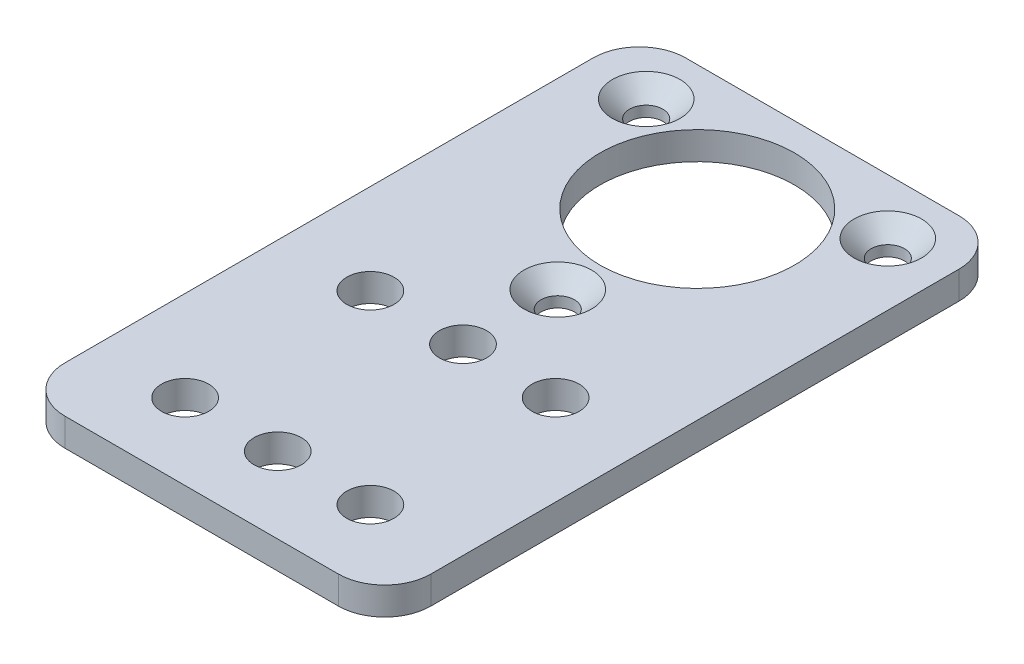
ISO-10303-21;
HEADER;
FILE_DESCRIPTION(('STEP AP214'),'2;1');
FILE_NAME('part.step','',(''),(''),'','','');
FILE_SCHEMA(('AUTOMOTIVE_DESIGN { 1 0 10303 214 1 1 1 1 }'));
ENDSEC;
DATA;
#1=APPLICATION_CONTEXT('core data for automotive mechanical design processes');
#2=APPLICATION_PROTOCOL_DEFINITION('international standard','automotive_design',2000,#1);
#3=PRODUCT_CONTEXT('',#1,'mechanical');
#4=PRODUCT('Part','Part','',(#3));
#5=PRODUCT_RELATED_PRODUCT_CATEGORY('part','',(#4));
#6=PRODUCT_DEFINITION_FORMATION('','',#4);
#7=PRODUCT_DEFINITION_CONTEXT('part definition',#1,'design');
#8=PRODUCT_DEFINITION('design','',#6,#7);
#9=PRODUCT_DEFINITION_SHAPE('','',#8);
#10=(LENGTH_UNIT() NAMED_UNIT(*) SI_UNIT(.MILLI.,.METRE.));
#11=(NAMED_UNIT(*) PLANE_ANGLE_UNIT() SI_UNIT($,.RADIAN.));
#12=(NAMED_UNIT(*) SI_UNIT($,.STERADIAN.) SOLID_ANGLE_UNIT());
#13=UNCERTAINTY_MEASURE_WITH_UNIT(LENGTH_MEASURE(1.E-05),#10,'distance_accuracy_value','');
#14=(GEOMETRIC_REPRESENTATION_CONTEXT(3) GLOBAL_UNCERTAINTY_ASSIGNED_CONTEXT((#13)) GLOBAL_UNIT_ASSIGNED_CONTEXT((#10,
#11,#12)) REPRESENTATION_CONTEXT('',''));
#15=CARTESIAN_POINT('',(0.,0.,0.));
#16=DIRECTION('',(0.,0.,1.));
#17=DIRECTION('',(1.,0.,0.));
#18=AXIS2_PLACEMENT_3D('',#15,#16,#17);
#19=CARTESIAN_POINT('',(-14.75,3.,28.5));
#20=DIRECTION('',(0.,-1.,0.));
#21=DIRECTION('',(0.,0.,-1.));
#22=AXIS2_PLACEMENT_3D('',#19,#20,#21);
#23=PLANE('',#22);
#24=CARTESIAN_POINT('',(-13.0423425809937,3.,-27.5299999999999));
#25=DIRECTION('',(0.,1.,0.));
#26=DIRECTION('',(0.,0.,1.));
#27=AXIS2_PLACEMENT_3D('',#24,#25,#26);
#28=CIRCLE('',#27,3.65);
#29=CARTESIAN_POINT('',(-13.0423425809937,3.,-23.8799999999999));
#30=VERTEX_POINT('',#29);
#31=EDGE_CURVE('E260',#30,#30,#28,.T.);
#32=ORIENTED_EDGE('',*,*,#31,.F.);
#33=EDGE_LOOP('',(#32));
#34=FACE_BOUND('',#33,.T.);
#35=CARTESIAN_POINT('',(13.0423425809936,3.,-27.5300000000001));
#36=DIRECTION('',(0.,1.,0.));
#37=DIRECTION('',(0.,0.,1.));
#38=AXIS2_PLACEMENT_3D('',#35,#36,#37);
#39=CIRCLE('',#38,3.65);
#40=CARTESIAN_POINT('',(13.0423425809936,3.,-23.8800000000001));
#41=VERTEX_POINT('',#40);
#42=EDGE_CURVE('E251',#41,#41,#39,.T.);
#43=ORIENTED_EDGE('',*,*,#42,.F.);
#44=EDGE_LOOP('',(#43));
#45=FACE_BOUND('',#44,.T.);
#46=CARTESIAN_POINT('',(0.,3.,-20.));
#47=DIRECTION('',(0.,1.,0.));
#48=DIRECTION('',(0.,0.,1.));
#49=AXIS2_PLACEMENT_3D('',#46,#47,#48);
#50=CIRCLE('',#49,10.5);
#51=CARTESIAN_POINT('',(0.,3.,-9.5));
#52=VERTEX_POINT('',#51);
#53=EDGE_CURVE('E231',#52,#52,#50,.T.);
#54=ORIENTED_EDGE('',*,*,#53,.F.);
#55=EDGE_LOOP('',(#54));
#56=FACE_BOUND('',#55,.T.);
#57=CARTESIAN_POINT('',(-14.75,3.,28.5));
#58=DIRECTION('',(0.,1.,0.));
#59=DIRECTION('',(0.,0.,-1.));
#60=AXIS2_PLACEMENT_3D('',#57,#58,#59);
#61=CIRCLE('',#60,5.);
#62=CARTESIAN_POINT('',(-19.75,3.,28.5));
#63=VERTEX_POINT('',#62);
#64=CARTESIAN_POINT('',(-14.75,3.,33.5));
#65=VERTEX_POINT('',#64);
#66=EDGE_CURVE('E161',#63,#65,#61,.T.);
#67=ORIENTED_EDGE('',*,*,#66,.T.);
#68=DIRECTION('',(1.,0.,0.));
#69=VECTOR('',#68,1.);
#70=CARTESIAN_POINT('',(14.75,3.,33.5));
#71=LINE('',#70,#69);
#72=CARTESIAN_POINT('',(14.75,3.,33.5));
#73=VERTEX_POINT('',#72);
#74=EDGE_CURVE('E109',#65,#73,#71,.T.);
#75=ORIENTED_EDGE('',*,*,#74,.T.);
#76=CARTESIAN_POINT('',(14.75,3.,28.5));
#77=DIRECTION('',(0.,1.,0.));
#78=DIRECTION('',(0.,0.,1.));
#79=AXIS2_PLACEMENT_3D('',#76,#77,#78);
#80=CIRCLE('',#79,5.00000000000001);
#81=CARTESIAN_POINT('',(19.75,3.,28.5));
#82=VERTEX_POINT('',#81);
#83=EDGE_CURVE('E176',#73,#82,#80,.T.);
#84=ORIENTED_EDGE('',*,*,#83,.T.);
#85=DIRECTION('',(0.,0.,-1.));
#86=VECTOR('',#85,1.);
#87=CARTESIAN_POINT('',(19.75,3.,28.5));
#88=LINE('',#87,#86);
#89=CARTESIAN_POINT('',(19.75,3.,-28.5));
#90=VERTEX_POINT('',#89);
#91=EDGE_CURVE('E189',#82,#90,#88,.T.);
#92=ORIENTED_EDGE('',*,*,#91,.T.);
#93=CARTESIAN_POINT('',(14.75,3.,-28.5));
#94=DIRECTION('',(0.,1.,0.));
#95=DIRECTION('',(0.,0.,1.));
#96=AXIS2_PLACEMENT_3D('',#93,#94,#95);
#97=CIRCLE('',#96,5.);
#98=CARTESIAN_POINT('',(14.75,3.,-33.5));
#99=VERTEX_POINT('',#98);
#100=EDGE_CURVE('E128',#90,#99,#97,.T.);
#101=ORIENTED_EDGE('',*,*,#100,.T.);
#102=DIRECTION('',(-1.,0.,0.));
#103=VECTOR('',#102,1.);
#104=CARTESIAN_POINT('',(14.75,3.,-33.5));
#105=LINE('',#104,#103);
#106=CARTESIAN_POINT('',(-14.75,3.,-33.5));
#107=VERTEX_POINT('',#106);
#108=EDGE_CURVE('E122',#99,#107,#105,.T.);
#109=ORIENTED_EDGE('',*,*,#108,.T.);
#110=CARTESIAN_POINT('',(-14.75,3.,-28.5));
#111=DIRECTION('',(0.,1.,0.));
#112=DIRECTION('',(0.,0.,1.));
#113=AXIS2_PLACEMENT_3D('',#110,#111,#112);
#114=CIRCLE('',#113,5.);
#115=CARTESIAN_POINT('',(-19.75,3.,-28.5));
#116=VERTEX_POINT('',#115);
#117=EDGE_CURVE('E126',#107,#116,#114,.T.);
#118=ORIENTED_EDGE('',*,*,#117,.T.);
#119=DIRECTION('',(0.,0.,1.));
#120=VECTOR('',#119,1.);
#121=CARTESIAN_POINT('',(-19.75,3.,28.5));
#122=LINE('',#121,#120);
#123=EDGE_CURVE('E66',#116,#63,#122,.T.);
#124=ORIENTED_EDGE('',*,*,#123,.T.);
#125=EDGE_LOOP('',(#67,#75,#84,#92,#101,#109,#118,#124));
#126=FACE_BOUND('',#125,.T.);
#127=CARTESIAN_POINT('',(10.,3.,25.29));
#128=DIRECTION('',(0.,1.,0.));
#129=DIRECTION('',(0.,0.,1.));
#130=AXIS2_PLACEMENT_3D('',#127,#128,#129);
#131=CIRCLE('',#130,2.55);
#132=CARTESIAN_POINT('',(10.,3.,27.84));
#133=VERTEX_POINT('',#132);
#134=EDGE_CURVE('E150',#133,#133,#131,.T.);
#135=ORIENTED_EDGE('',*,*,#134,.F.);
#136=EDGE_LOOP('',(#135));
#137=FACE_BOUND('',#136,.T.);
#138=CARTESIAN_POINT('',(10.,3.,5.29));
#139=DIRECTION('',(0.,1.,0.));
#140=DIRECTION('',(0.,0.,1.));
#141=AXIS2_PLACEMENT_3D('',#138,#139,#140);
#142=CIRCLE('',#141,2.55);
#143=CARTESIAN_POINT('',(10.,3.,7.84));
#144=VERTEX_POINT('',#143);
#145=EDGE_CURVE('E198',#144,#144,#142,.T.);
#146=ORIENTED_EDGE('',*,*,#145,.F.);
#147=EDGE_LOOP('',(#146));
#148=FACE_BOUND('',#147,.T.);
#149=CARTESIAN_POINT('',(0.,3.,25.29));
#150=DIRECTION('',(0.,1.,0.));
#151=DIRECTION('',(0.,0.,1.));
#152=AXIS2_PLACEMENT_3D('',#149,#150,#151);
#153=CIRCLE('',#152,2.55);
#154=CARTESIAN_POINT('',(0.,3.,27.84));
#155=VERTEX_POINT('',#154);
#156=EDGE_CURVE('E204',#155,#155,#153,.T.);
#157=ORIENTED_EDGE('',*,*,#156,.F.);
#158=EDGE_LOOP('',(#157));
#159=FACE_BOUND('',#158,.T.);
#160=CARTESIAN_POINT('',(0.,3.,5.29));
#161=DIRECTION('',(0.,1.,0.));
#162=DIRECTION('',(0.,0.,1.));
#163=AXIS2_PLACEMENT_3D('',#160,#161,#162);
#164=CIRCLE('',#163,2.55);
#165=CARTESIAN_POINT('',(0.,3.,7.84));
#166=VERTEX_POINT('',#165);
#167=EDGE_CURVE('E210',#166,#166,#164,.T.);
#168=ORIENTED_EDGE('',*,*,#167,.F.);
#169=EDGE_LOOP('',(#168));
#170=FACE_BOUND('',#169,.T.);
#171=CARTESIAN_POINT('',(-9.99999999999999,3.,25.29));
#172=DIRECTION('',(0.,1.,0.));
#173=DIRECTION('',(0.,0.,1.));
#174=AXIS2_PLACEMENT_3D('',#171,#172,#173);
#175=CIRCLE('',#174,2.55);
#176=CARTESIAN_POINT('',(-9.99999999999999,3.,27.84));
#177=VERTEX_POINT('',#176);
#178=EDGE_CURVE('E216',#177,#177,#175,.T.);
#179=ORIENTED_EDGE('',*,*,#178,.F.);
#180=EDGE_LOOP('',(#179));
#181=FACE_BOUND('',#180,.T.);
#182=CARTESIAN_POINT('',(-9.99999999999999,3.,5.29));
#183=DIRECTION('',(0.,1.,0.));
#184=DIRECTION('',(0.,0.,1.));
#185=AXIS2_PLACEMENT_3D('',#182,#183,#184);
#186=CIRCLE('',#185,2.55);
#187=CARTESIAN_POINT('',(-9.99999999999999,3.,7.84));
#188=VERTEX_POINT('',#187);
#189=EDGE_CURVE('E222',#188,#188,#186,.T.);
#190=ORIENTED_EDGE('',*,*,#189,.F.);
#191=EDGE_LOOP('',(#190));
#192=FACE_BOUND('',#191,.T.);
#193=CARTESIAN_POINT('',(0.,3.,-4.94));
#194=DIRECTION('',(0.,1.,0.));
#195=DIRECTION('',(0.,0.,1.));
#196=AXIS2_PLACEMENT_3D('',#193,#194,#195);
#197=CIRCLE('',#196,3.65);
#198=CARTESIAN_POINT('',(0.,3.,-1.29));
#199=VERTEX_POINT('',#198);
#200=EDGE_CURVE('E242',#199,#199,#197,.T.);
#201=ORIENTED_EDGE('',*,*,#200,.F.);
#202=EDGE_LOOP('',(#201));
#203=FACE_BOUND('',#202,.T.);
#204=ADVANCED_FACE('F49',(#34,#45,#56,#126,#137,#148,#159,#170,#181,#192,#203),#23,.F.);
#205=CARTESIAN_POINT('',(-14.75,0.,28.5));
#206=DIRECTION('',(0.,-1.,0.));
#207=DIRECTION('',(0.,0.,-1.));
#208=AXIS2_PLACEMENT_3D('',#205,#206,#207);
#209=PLANE('',#208);
#210=CARTESIAN_POINT('',(-13.0423425809937,0.,-27.5299999999999));
#211=DIRECTION('',(0.,1.,0.));
#212=DIRECTION('',(0.,0.,1.));
#213=AXIS2_PLACEMENT_3D('',#210,#211,#212);
#214=CIRCLE('',#213,1.8);
#215=CARTESIAN_POINT('',(-13.0423425809937,0.,-25.7299999999999));
#216=VERTEX_POINT('',#215);
#217=EDGE_CURVE('E254',#216,#216,#214,.T.);
#218=ORIENTED_EDGE('',*,*,#217,.T.);
#219=EDGE_LOOP('',(#218));
#220=FACE_BOUND('',#219,.T.);
#221=CARTESIAN_POINT('',(13.0423425809936,0.,-27.5300000000001));
#222=DIRECTION('',(0.,1.,0.));
#223=DIRECTION('',(0.,0.,1.));
#224=AXIS2_PLACEMENT_3D('',#221,#222,#223);
#225=CIRCLE('',#224,1.8);
#226=CARTESIAN_POINT('',(13.0423425809936,0.,-25.7300000000001));
#227=VERTEX_POINT('',#226);
#228=EDGE_CURVE('E245',#227,#227,#225,.T.);
#229=ORIENTED_EDGE('',*,*,#228,.T.);
#230=EDGE_LOOP('',(#229));
#231=FACE_BOUND('',#230,.T.);
#232=CARTESIAN_POINT('',(0.,0.,-4.94));
#233=DIRECTION('',(0.,1.,0.));
#234=DIRECTION('',(0.,0.,1.));
#235=AXIS2_PLACEMENT_3D('',#232,#233,#234);
#236=CIRCLE('',#235,1.8);
#237=CARTESIAN_POINT('',(0.,0.,-3.14));
#238=VERTEX_POINT('',#237);
#239=EDGE_CURVE('E234',#238,#238,#236,.T.);
#240=ORIENTED_EDGE('',*,*,#239,.T.);
#241=EDGE_LOOP('',(#240));
#242=FACE_BOUND('',#241,.T.);
#243=CARTESIAN_POINT('',(0.,0.,-20.));
#244=DIRECTION('',(0.,1.,0.));
#245=DIRECTION('',(0.,0.,1.));
#246=AXIS2_PLACEMENT_3D('',#243,#244,#245);
#247=CIRCLE('',#246,10.5);
#248=CARTESIAN_POINT('',(0.,0.,-9.5));
#249=VERTEX_POINT('',#248);
#250=EDGE_CURVE('E228',#249,#249,#247,.T.);
#251=ORIENTED_EDGE('',*,*,#250,.T.);
#252=EDGE_LOOP('',(#251));
#253=FACE_BOUND('',#252,.T.);
#254=CARTESIAN_POINT('',(-9.99999999999999,0.,25.29));
#255=DIRECTION('',(0.,1.,0.));
#256=DIRECTION('',(0.,0.,1.));
#257=AXIS2_PLACEMENT_3D('',#254,#255,#256);
#258=CIRCLE('',#257,2.55);
#259=CARTESIAN_POINT('',(-9.99999999999999,0.,27.84));
#260=VERTEX_POINT('',#259);
#261=EDGE_CURVE('E219',#260,#260,#258,.T.);
#262=ORIENTED_EDGE('',*,*,#261,.T.);
#263=EDGE_LOOP('',(#262));
#264=FACE_BOUND('',#263,.T.);
#265=CARTESIAN_POINT('',(0.,0.,25.29));
#266=DIRECTION('',(0.,1.,0.));
#267=DIRECTION('',(0.,0.,1.));
#268=AXIS2_PLACEMENT_3D('',#265,#266,#267);
#269=CIRCLE('',#268,2.55);
#270=CARTESIAN_POINT('',(0.,0.,27.84));
#271=VERTEX_POINT('',#270);
#272=EDGE_CURVE('E207',#271,#271,#269,.T.);
#273=ORIENTED_EDGE('',*,*,#272,.T.);
#274=EDGE_LOOP('',(#273));
#275=FACE_BOUND('',#274,.T.);
#276=CARTESIAN_POINT('',(10.,0.,25.29));
#277=DIRECTION('',(0.,1.,0.));
#278=DIRECTION('',(0.,0.,1.));
#279=AXIS2_PLACEMENT_3D('',#276,#277,#278);
#280=CIRCLE('',#279,2.55);
#281=CARTESIAN_POINT('',(10.,0.,27.84));
#282=VERTEX_POINT('',#281);
#283=EDGE_CURVE('E195',#282,#282,#280,.T.);
#284=ORIENTED_EDGE('',*,*,#283,.T.);
#285=EDGE_LOOP('',(#284));
#286=FACE_BOUND('',#285,.T.);
#287=CARTESIAN_POINT('',(-14.75,0.,28.5));
#288=DIRECTION('',(0.,1.,0.));
#289=DIRECTION('',(0.,0.,-1.));
#290=AXIS2_PLACEMENT_3D('',#287,#288,#289);
#291=CIRCLE('',#290,5.);
#292=CARTESIAN_POINT('',(-19.75,0.,28.5));
#293=VERTEX_POINT('',#292);
#294=CARTESIAN_POINT('',(-14.75,0.,33.5));
#295=VERTEX_POINT('',#294);
#296=EDGE_CURVE('E146',#293,#295,#291,.T.);
#297=ORIENTED_EDGE('',*,*,#296,.F.);
#298=DIRECTION('',(0.,0.,1.));
#299=VECTOR('',#298,1.);
#300=CARTESIAN_POINT('',(-19.75,0.,28.5));
#301=LINE('',#300,#299);
#302=CARTESIAN_POINT('',(-19.75,0.,-28.5));
#303=VERTEX_POINT('',#302);
#304=EDGE_CURVE('E101',#303,#293,#301,.T.);
#305=ORIENTED_EDGE('',*,*,#304,.F.);
#306=CARTESIAN_POINT('',(-14.75,0.,-28.5));
#307=DIRECTION('',(0.,1.,0.));
#308=DIRECTION('',(0.,0.,1.));
#309=AXIS2_PLACEMENT_3D('',#306,#307,#308);
#310=CIRCLE('',#309,5.);
#311=CARTESIAN_POINT('',(-14.75,0.,-33.5));
#312=VERTEX_POINT('',#311);
#313=EDGE_CURVE('E95',#312,#303,#310,.T.);
#314=ORIENTED_EDGE('',*,*,#313,.F.);
#315=DIRECTION('',(-1.,0.,0.));
#316=VECTOR('',#315,1.);
#317=CARTESIAN_POINT('',(14.75,0.,-33.5));
#318=LINE('',#317,#316);
#319=CARTESIAN_POINT('',(14.75,0.,-33.5));
#320=VERTEX_POINT('',#319);
#321=EDGE_CURVE('E136',#320,#312,#318,.T.);
#322=ORIENTED_EDGE('',*,*,#321,.F.);
#323=CARTESIAN_POINT('',(14.75,0.,-28.5));
#324=DIRECTION('',(0.,1.,0.));
#325=DIRECTION('',(0.,0.,1.));
#326=AXIS2_PLACEMENT_3D('',#323,#324,#325);
#327=CIRCLE('',#326,5.);
#328=CARTESIAN_POINT('',(19.75,0.,-28.5));
#329=VERTEX_POINT('',#328);
#330=EDGE_CURVE('E156',#329,#320,#327,.T.);
#331=ORIENTED_EDGE('',*,*,#330,.F.);
#332=DIRECTION('',(0.,0.,-1.));
#333=VECTOR('',#332,1.);
#334=CARTESIAN_POINT('',(19.75,0.,28.5));
#335=LINE('',#334,#333);
#336=CARTESIAN_POINT('',(19.75,0.,28.5));
#337=VERTEX_POINT('',#336);
#338=EDGE_CURVE('E154',#337,#329,#335,.T.);
#339=ORIENTED_EDGE('',*,*,#338,.F.);
#340=CARTESIAN_POINT('',(14.75,0.,28.5));
#341=DIRECTION('',(0.,1.,0.));
#342=DIRECTION('',(0.,0.,1.));
#343=AXIS2_PLACEMENT_3D('',#340,#341,#342);
#344=CIRCLE('',#343,5.00000000000001);
#345=CARTESIAN_POINT('',(14.75,0.,33.5));
#346=VERTEX_POINT('',#345);
#347=EDGE_CURVE('E152',#346,#337,#344,.T.);
#348=ORIENTED_EDGE('',*,*,#347,.F.);
#349=DIRECTION('',(1.,0.,0.));
#350=VECTOR('',#349,1.);
#351=CARTESIAN_POINT('',(14.75,0.,33.5));
#352=LINE('',#351,#350);
#353=EDGE_CURVE('E149',#295,#346,#352,.T.);
#354=ORIENTED_EDGE('',*,*,#353,.F.);
#355=EDGE_LOOP('',(#297,#305,#314,#322,#331,#339,#348,#354));
#356=FACE_BOUND('',#355,.T.);
#357=CARTESIAN_POINT('',(10.,0.,5.29));
#358=DIRECTION('',(0.,1.,0.));
#359=DIRECTION('',(0.,0.,1.));
#360=AXIS2_PLACEMENT_3D('',#357,#358,#359);
#361=CIRCLE('',#360,2.55);
#362=CARTESIAN_POINT('',(10.,0.,7.84));
#363=VERTEX_POINT('',#362);
#364=EDGE_CURVE('E201',#363,#363,#361,.T.);
#365=ORIENTED_EDGE('',*,*,#364,.T.);
#366=EDGE_LOOP('',(#365));
#367=FACE_BOUND('',#366,.T.);
#368=CARTESIAN_POINT('',(0.,0.,5.29));
#369=DIRECTION('',(0.,1.,0.));
#370=DIRECTION('',(0.,0.,1.));
#371=AXIS2_PLACEMENT_3D('',#368,#369,#370);
#372=CIRCLE('',#371,2.55);
#373=CARTESIAN_POINT('',(0.,0.,7.84));
#374=VERTEX_POINT('',#373);
#375=EDGE_CURVE('E213',#374,#374,#372,.T.);
#376=ORIENTED_EDGE('',*,*,#375,.T.);
#377=EDGE_LOOP('',(#376));
#378=FACE_BOUND('',#377,.T.);
#379=CARTESIAN_POINT('',(-9.99999999999999,0.,5.29));
#380=DIRECTION('',(0.,1.,0.));
#381=DIRECTION('',(0.,0.,1.));
#382=AXIS2_PLACEMENT_3D('',#379,#380,#381);
#383=CIRCLE('',#382,2.55);
#384=CARTESIAN_POINT('',(-9.99999999999999,0.,7.84));
#385=VERTEX_POINT('',#384);
#386=EDGE_CURVE('E225',#385,#385,#383,.T.);
#387=ORIENTED_EDGE('',*,*,#386,.T.);
#388=EDGE_LOOP('',(#387));
#389=FACE_BOUND('',#388,.T.);
#390=ADVANCED_FACE('F180',(#220,#231,#242,#253,#264,#275,#286,#356,#367,#378,#389),#209,.T.);
#391=CARTESIAN_POINT('',(-14.75,3.,28.5));
#392=DIRECTION('',(0.,-1.,0.));
#393=DIRECTION('',(0.,0.,-1.));
#394=AXIS2_PLACEMENT_3D('',#391,#392,#393);
#395=CYLINDRICAL_SURFACE('',#394,5.);
#396=ORIENTED_EDGE('',*,*,#296,.T.);
#397=DIRECTION('',(0.,-1.,0.));
#398=VECTOR('',#397,1.);
#399=CARTESIAN_POINT('',(-14.75,3.,33.5));
#400=LINE('',#399,#398);
#401=EDGE_CURVE('E13',#65,#295,#400,.T.);
#402=ORIENTED_EDGE('',*,*,#401,.F.);
#403=ORIENTED_EDGE('',*,*,#66,.F.);
#404=DIRECTION('',(0.,-1.,0.));
#405=VECTOR('',#404,1.);
#406=CARTESIAN_POINT('',(-19.75,3.,28.5));
#407=LINE('',#406,#405);
#408=EDGE_CURVE('E142',#63,#293,#407,.T.);
#409=ORIENTED_EDGE('',*,*,#408,.T.);
#410=EDGE_LOOP('',(#396,#402,#403,#409));
#411=FACE_BOUND('',#410,.T.);
#412=ADVANCED_FACE('F51',(#411),#395,.T.);
#413=CARTESIAN_POINT('',(14.75,3.,33.5));
#414=DIRECTION('',(0.,0.,-1.));
#415=DIRECTION('',(-1.,0.,0.));
#416=AXIS2_PLACEMENT_3D('',#413,#414,#415);
#417=PLANE('',#416);
#418=ORIENTED_EDGE('',*,*,#353,.T.);
#419=DIRECTION('',(0.,-1.,0.));
#420=VECTOR('',#419,1.);
#421=CARTESIAN_POINT('',(14.75,3.,33.5));
#422=LINE('',#421,#420);
#423=EDGE_CURVE('E58',#73,#346,#422,.T.);
#424=ORIENTED_EDGE('',*,*,#423,.F.);
#425=ORIENTED_EDGE('',*,*,#74,.F.);
#426=ORIENTED_EDGE('',*,*,#401,.T.);
#427=EDGE_LOOP('',(#418,#424,#425,#426));
#428=FACE_BOUND('',#427,.T.);
#429=ADVANCED_FACE('F326',(#428),#417,.F.);
#430=CARTESIAN_POINT('',(14.75,3.,28.5));
#431=DIRECTION('',(0.,-1.,0.));
#432=DIRECTION('',(0.,0.,-1.));
#433=AXIS2_PLACEMENT_3D('',#430,#431,#432);
#434=CYLINDRICAL_SURFACE('',#433,5.00000000000001);
#435=ORIENTED_EDGE('',*,*,#347,.T.);
#436=DIRECTION('',(0.,-1.,0.));
#437=VECTOR('',#436,1.);
#438=CARTESIAN_POINT('',(19.75,3.,28.5));
#439=LINE('',#438,#437);
#440=EDGE_CURVE('E168',#82,#337,#439,.T.);
#441=ORIENTED_EDGE('',*,*,#440,.F.);
#442=ORIENTED_EDGE('',*,*,#83,.F.);
#443=ORIENTED_EDGE('',*,*,#423,.T.);
#444=EDGE_LOOP('',(#435,#441,#442,#443));
#445=FACE_BOUND('',#444,.T.);
#446=ADVANCED_FACE('F174',(#445),#434,.T.);
#447=CARTESIAN_POINT('',(19.75,3.,28.5));
#448=DIRECTION('',(-1.,0.,0.));
#449=DIRECTION('',(0.,0.,1.));
#450=AXIS2_PLACEMENT_3D('',#447,#448,#449);
#451=PLANE('',#450);
#452=ORIENTED_EDGE('',*,*,#338,.T.);
#453=DIRECTION('',(0.,-1.,0.));
#454=VECTOR('',#453,1.);
#455=CARTESIAN_POINT('',(19.75,3.,-28.5));
#456=LINE('',#455,#454);
#457=EDGE_CURVE('E165',#90,#329,#456,.T.);
#458=ORIENTED_EDGE('',*,*,#457,.F.);
#459=ORIENTED_EDGE('',*,*,#91,.F.);
#460=ORIENTED_EDGE('',*,*,#440,.T.);
#461=EDGE_LOOP('',(#452,#458,#459,#460));
#462=FACE_BOUND('',#461,.T.);
#463=ADVANCED_FACE('F185',(#462),#451,.F.);
#464=CARTESIAN_POINT('',(14.75,3.,-28.5));
#465=DIRECTION('',(0.,-1.,0.));
#466=DIRECTION('',(0.,0.,-1.));
#467=AXIS2_PLACEMENT_3D('',#464,#465,#466);
#468=CYLINDRICAL_SURFACE('',#467,5.);
#469=ORIENTED_EDGE('',*,*,#330,.T.);
#470=DIRECTION('',(0.,-1.,0.));
#471=VECTOR('',#470,1.);
#472=CARTESIAN_POINT('',(14.75,3.,-33.5));
#473=LINE('',#472,#471);
#474=EDGE_CURVE('E137',#99,#320,#473,.T.);
#475=ORIENTED_EDGE('',*,*,#474,.F.);
#476=ORIENTED_EDGE('',*,*,#100,.F.);
#477=ORIENTED_EDGE('',*,*,#457,.T.);
#478=EDGE_LOOP('',(#469,#475,#476,#477));
#479=FACE_BOUND('',#478,.T.);
#480=ADVANCED_FACE('F188',(#479),#468,.T.);
#481=CARTESIAN_POINT('',(14.75,3.,-33.5));
#482=DIRECTION('',(0.,0.,1.));
#483=DIRECTION('',(1.,0.,0.));
#484=AXIS2_PLACEMENT_3D('',#481,#482,#483);
#485=PLANE('',#484);
#486=ORIENTED_EDGE('',*,*,#321,.T.);
#487=DIRECTION('',(0.,-1.,0.));
#488=VECTOR('',#487,1.);
#489=CARTESIAN_POINT('',(-14.75,3.,-33.5));
#490=LINE('',#489,#488);
#491=EDGE_CURVE('E133',#107,#312,#490,.T.);
#492=ORIENTED_EDGE('',*,*,#491,.F.);
#493=ORIENTED_EDGE('',*,*,#108,.F.);
#494=ORIENTED_EDGE('',*,*,#474,.T.);
#495=EDGE_LOOP('',(#486,#492,#493,#494));
#496=FACE_BOUND('',#495,.T.);
#497=ADVANCED_FACE('F134',(#496),#485,.F.);
#498=CARTESIAN_POINT('',(-14.75,3.,-28.5));
#499=DIRECTION('',(0.,-1.,0.));
#500=DIRECTION('',(0.,0.,-1.));
#501=AXIS2_PLACEMENT_3D('',#498,#499,#500);
#502=CYLINDRICAL_SURFACE('',#501,5.);
#503=ORIENTED_EDGE('',*,*,#313,.T.);
#504=DIRECTION('',(0.,-1.,0.));
#505=VECTOR('',#504,1.);
#506=CARTESIAN_POINT('',(-19.75,3.,-28.5));
#507=LINE('',#506,#505);
#508=EDGE_CURVE('E138',#116,#303,#507,.T.);
#509=ORIENTED_EDGE('',*,*,#508,.F.);
#510=ORIENTED_EDGE('',*,*,#117,.F.);
#511=ORIENTED_EDGE('',*,*,#491,.T.);
#512=EDGE_LOOP('',(#503,#509,#510,#511));
#513=FACE_BOUND('',#512,.T.);
#514=ADVANCED_FACE('F140',(#513),#502,.T.);
#515=CARTESIAN_POINT('',(-19.75,3.,28.5));
#516=DIRECTION('',(1.,0.,0.));
#517=DIRECTION('',(0.,0.,-1.));
#518=AXIS2_PLACEMENT_3D('',#515,#516,#517);
#519=PLANE('',#518);
#520=ORIENTED_EDGE('',*,*,#304,.T.);
#521=ORIENTED_EDGE('',*,*,#408,.F.);
#522=ORIENTED_EDGE('',*,*,#123,.F.);
#523=ORIENTED_EDGE('',*,*,#508,.T.);
#524=EDGE_LOOP('',(#520,#521,#522,#523));
#525=FACE_BOUND('',#524,.T.);
#526=ADVANCED_FACE('F309',(#525),#519,.F.);
#527=CARTESIAN_POINT('',(10.,3.,25.29));
#528=DIRECTION('',(0.,-1.,0.));
#529=DIRECTION('',(0.,0.,-1.));
#530=AXIS2_PLACEMENT_3D('',#527,#528,#529);
#531=CYLINDRICAL_SURFACE('',#530,2.55);
#532=ORIENTED_EDGE('',*,*,#134,.T.);
#533=EDGE_LOOP('',(#532));
#534=FACE_BOUND('',#533,.T.);
#535=ORIENTED_EDGE('',*,*,#283,.F.);
#536=EDGE_LOOP('',(#535));
#537=FACE_BOUND('',#536,.T.);
#538=ADVANCED_FACE('F306',(#534,#537),#531,.F.);
#539=CARTESIAN_POINT('',(10.,3.,5.29));
#540=DIRECTION('',(0.,-1.,0.));
#541=DIRECTION('',(0.,0.,-1.));
#542=AXIS2_PLACEMENT_3D('',#539,#540,#541);
#543=CYLINDRICAL_SURFACE('',#542,2.55);
#544=ORIENTED_EDGE('',*,*,#145,.T.);
#545=EDGE_LOOP('',(#544));
#546=FACE_BOUND('',#545,.T.);
#547=ORIENTED_EDGE('',*,*,#364,.F.);
#548=EDGE_LOOP('',(#547));
#549=FACE_BOUND('',#548,.T.);
#550=ADVANCED_FACE('F302',(#546,#549),#543,.F.);
#551=CARTESIAN_POINT('',(0.,3.,25.29));
#552=DIRECTION('',(0.,-1.,0.));
#553=DIRECTION('',(0.,0.,-1.));
#554=AXIS2_PLACEMENT_3D('',#551,#552,#553);
#555=CYLINDRICAL_SURFACE('',#554,2.55);
#556=ORIENTED_EDGE('',*,*,#156,.T.);
#557=EDGE_LOOP('',(#556));
#558=FACE_BOUND('',#557,.T.);
#559=ORIENTED_EDGE('',*,*,#272,.F.);
#560=EDGE_LOOP('',(#559));
#561=FACE_BOUND('',#560,.T.);
#562=ADVANCED_FACE('F298',(#558,#561),#555,.F.);
#563=CARTESIAN_POINT('',(0.,3.,5.29));
#564=DIRECTION('',(0.,-1.,0.));
#565=DIRECTION('',(0.,0.,-1.));
#566=AXIS2_PLACEMENT_3D('',#563,#564,#565);
#567=CYLINDRICAL_SURFACE('',#566,2.55);
#568=ORIENTED_EDGE('',*,*,#167,.T.);
#569=EDGE_LOOP('',(#568));
#570=FACE_BOUND('',#569,.T.);
#571=ORIENTED_EDGE('',*,*,#375,.F.);
#572=EDGE_LOOP('',(#571));
#573=FACE_BOUND('',#572,.T.);
#574=ADVANCED_FACE('F294',(#570,#573),#567,.F.);
#575=CARTESIAN_POINT('',(-9.99999999999999,3.,25.29));
#576=DIRECTION('',(0.,-1.,0.));
#577=DIRECTION('',(0.,0.,-1.));
#578=AXIS2_PLACEMENT_3D('',#575,#576,#577);
#579=CYLINDRICAL_SURFACE('',#578,2.55);
#580=ORIENTED_EDGE('',*,*,#178,.T.);
#581=EDGE_LOOP('',(#580));
#582=FACE_BOUND('',#581,.T.);
#583=ORIENTED_EDGE('',*,*,#261,.F.);
#584=EDGE_LOOP('',(#583));
#585=FACE_BOUND('',#584,.T.);
#586=ADVANCED_FACE('F286',(#582,#585),#579,.F.);
#587=CARTESIAN_POINT('',(-9.99999999999999,3.,5.29));
#588=DIRECTION('',(0.,-1.,0.));
#589=DIRECTION('',(0.,0.,-1.));
#590=AXIS2_PLACEMENT_3D('',#587,#588,#589);
#591=CYLINDRICAL_SURFACE('',#590,2.55);
#592=ORIENTED_EDGE('',*,*,#189,.T.);
#593=EDGE_LOOP('',(#592));
#594=FACE_BOUND('',#593,.T.);
#595=ORIENTED_EDGE('',*,*,#386,.F.);
#596=EDGE_LOOP('',(#595));
#597=FACE_BOUND('',#596,.T.);
#598=ADVANCED_FACE('F276',(#594,#597),#591,.F.);
#599=CARTESIAN_POINT('',(0.,0.,-20.));
#600=DIRECTION('',(0.,1.,0.));
#601=DIRECTION('',(0.,0.,1.));
#602=AXIS2_PLACEMENT_3D('',#599,#600,#601);
#603=CYLINDRICAL_SURFACE('',#602,10.5);
#604=ORIENTED_EDGE('',*,*,#250,.F.);
#605=EDGE_LOOP('',(#604));
#606=FACE_BOUND('',#605,.T.);
#607=ORIENTED_EDGE('',*,*,#53,.T.);
#608=EDGE_LOOP('',(#607));
#609=FACE_BOUND('',#608,.T.);
#610=ADVANCED_FACE('F273',(#606,#609),#603,.F.);
#611=CARTESIAN_POINT('',(0.,3.,-4.94));
#612=DIRECTION('',(0.,1.,0.));
#613=DIRECTION('',(0.,0.,1.));
#614=AXIS2_PLACEMENT_3D('',#611,#612,#613);
#615=CYLINDRICAL_SURFACE('',#614,1.8);
#616=ORIENTED_EDGE('',*,*,#239,.F.);
#617=EDGE_LOOP('',(#616));
#618=FACE_BOUND('',#617,.T.);
#619=CARTESIAN_POINT('',(0.,1.15,-4.94));
#620=DIRECTION('',(0.,1.,0.));
#621=DIRECTION('',(0.,0.,1.));
#622=AXIS2_PLACEMENT_3D('',#619,#620,#621);
#623=CIRCLE('',#622,1.8);
#624=CARTESIAN_POINT('',(0.,1.15,-3.14));
#625=VERTEX_POINT('',#624);
#626=EDGE_CURVE('E239',#625,#625,#623,.T.);
#627=ORIENTED_EDGE('',*,*,#626,.T.);
#628=EDGE_LOOP('',(#627));
#629=FACE_BOUND('',#628,.T.);
#630=ADVANCED_FACE('F275',(#618,#629),#615,.F.);
#631=CARTESIAN_POINT('',(0.,3.,-4.94));
#632=DIRECTION('',(0.,1.,0.));
#633=DIRECTION('',(0.,0.,1.));
#634=AXIS2_PLACEMENT_3D('',#631,#632,#633);
#635=CONICAL_SURFACE('',#634,3.65,0.785398163397448);
#636=ORIENTED_EDGE('',*,*,#626,.F.);
#637=EDGE_LOOP('',(#636));
#638=FACE_BOUND('',#637,.T.);
#639=ORIENTED_EDGE('',*,*,#200,.T.);
#640=EDGE_LOOP('',(#639));
#641=FACE_BOUND('',#640,.T.);
#642=ADVANCED_FACE('F283',(#638,#641),#635,.F.);
#643=CARTESIAN_POINT('',(13.0423425809936,3.,-27.5300000000001));
#644=DIRECTION('',(0.,1.,0.));
#645=DIRECTION('',(0.,0.,1.));
#646=AXIS2_PLACEMENT_3D('',#643,#644,#645);
#647=CYLINDRICAL_SURFACE('',#646,1.8);
#648=ORIENTED_EDGE('',*,*,#228,.F.);
#649=EDGE_LOOP('',(#648));
#650=FACE_BOUND('',#649,.T.);
#651=CARTESIAN_POINT('',(13.0423425809936,1.15,-27.5300000000001));
#652=DIRECTION('',(0.,1.,0.));
#653=DIRECTION('',(0.,0.,1.));
#654=AXIS2_PLACEMENT_3D('',#651,#652,#653);
#655=CIRCLE('',#654,1.8);
#656=CARTESIAN_POINT('',(13.0423425809936,1.15,-25.7300000000001));
#657=VERTEX_POINT('',#656);
#658=EDGE_CURVE('E248',#657,#657,#655,.T.);
#659=ORIENTED_EDGE('',*,*,#658,.T.);
#660=EDGE_LOOP('',(#659));
#661=FACE_BOUND('',#660,.T.);
#662=ADVANCED_FACE('F443',(#650,#661),#647,.F.);
#663=CARTESIAN_POINT('',(13.0423425809936,3.,-27.5300000000001));
#664=DIRECTION('',(0.,1.,0.));
#665=DIRECTION('',(0.,0.,1.));
#666=AXIS2_PLACEMENT_3D('',#663,#664,#665);
#667=CONICAL_SURFACE('',#666,3.65,0.785398163397448);
#668=ORIENTED_EDGE('',*,*,#658,.F.);
#669=EDGE_LOOP('',(#668));
#670=FACE_BOUND('',#669,.T.);
#671=ORIENTED_EDGE('',*,*,#42,.T.);
#672=EDGE_LOOP('',(#671));
#673=FACE_BOUND('',#672,.T.);
#674=ADVANCED_FACE('F451',(#670,#673),#667,.F.);
#675=CARTESIAN_POINT('',(-13.0423425809937,3.,-27.5299999999999));
#676=DIRECTION('',(0.,1.,0.));
#677=DIRECTION('',(0.,0.,1.));
#678=AXIS2_PLACEMENT_3D('',#675,#676,#677);
#679=CYLINDRICAL_SURFACE('',#678,1.8);
#680=ORIENTED_EDGE('',*,*,#217,.F.);
#681=EDGE_LOOP('',(#680));
#682=FACE_BOUND('',#681,.T.);
#683=CARTESIAN_POINT('',(-13.0423425809937,1.15,-27.5299999999999));
#684=DIRECTION('',(0.,1.,0.));
#685=DIRECTION('',(0.,0.,1.));
#686=AXIS2_PLACEMENT_3D('',#683,#684,#685);
#687=CIRCLE('',#686,1.8);
#688=CARTESIAN_POINT('',(-13.0423425809937,1.15,-25.7299999999999));
#689=VERTEX_POINT('',#688);
#690=EDGE_CURVE('E257',#689,#689,#687,.T.);
#691=ORIENTED_EDGE('',*,*,#690,.T.);
#692=EDGE_LOOP('',(#691));
#693=FACE_BOUND('',#692,.T.);
#694=ADVANCED_FACE('F460',(#682,#693),#679,.F.);
#695=CARTESIAN_POINT('',(-13.0423425809937,3.,-27.5299999999999));
#696=DIRECTION('',(0.,1.,0.));
#697=DIRECTION('',(0.,0.,1.));
#698=AXIS2_PLACEMENT_3D('',#695,#696,#697);
#699=CONICAL_SURFACE('',#698,3.65,0.785398163397448);
#700=ORIENTED_EDGE('',*,*,#690,.F.);
#701=EDGE_LOOP('',(#700));
#702=FACE_BOUND('',#701,.T.);
#703=ORIENTED_EDGE('',*,*,#31,.T.);
#704=EDGE_LOOP('',(#703));
#705=FACE_BOUND('',#704,.T.);
#706=ADVANCED_FACE('F264',(#702,#705),#699,.F.);
#707=CLOSED_SHELL('',(#204,#390,#412,#429,#446,#463,#480,#497,#514,#526,#538,#550,#562,#574,
#586,#598,#610,#630,#642,#662,#674,#694,#706));
#708=MANIFOLD_SOLID_BREP('B2',#707);
#709=ADVANCED_BREP_SHAPE_REPRESENTATION('',(#18,#708),#14);
#710=SHAPE_DEFINITION_REPRESENTATION(#9,#709);
ENDSEC;
END-ISO-10303-21;
